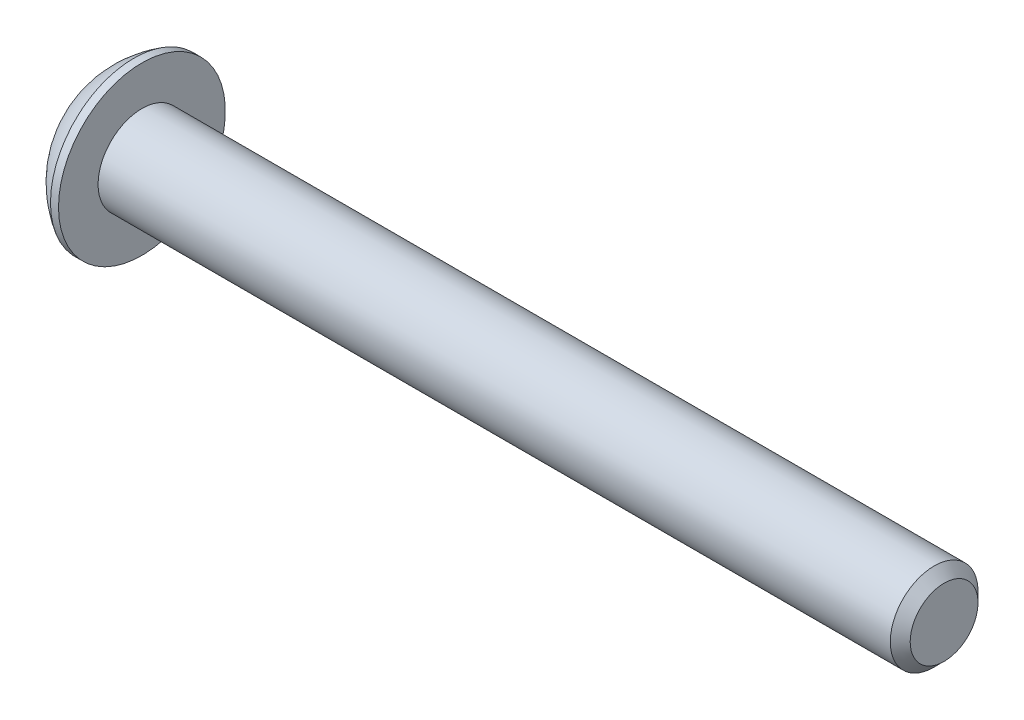
ISO-10303-21;
HEADER;
FILE_DESCRIPTION(('STEP AP214'),'2;1');
FILE_NAME('part.step','',(''),(''),'','','');
FILE_SCHEMA(('AUTOMOTIVE_DESIGN { 1 0 10303 214 1 1 1 1 }'));
ENDSEC;
DATA;
#1=APPLICATION_CONTEXT('core data for automotive mechanical design processes');
#2=APPLICATION_PROTOCOL_DEFINITION('international standard','automotive_design',2000,#1);
#3=PRODUCT_CONTEXT('',#1,'mechanical');
#4=PRODUCT('Part','Part','',(#3));
#5=PRODUCT_RELATED_PRODUCT_CATEGORY('part','',(#4));
#6=PRODUCT_DEFINITION_FORMATION('','',#4);
#7=PRODUCT_DEFINITION_CONTEXT('part definition',#1,'design');
#8=PRODUCT_DEFINITION('design','',#6,#7);
#9=PRODUCT_DEFINITION_SHAPE('','',#8);
#10=(LENGTH_UNIT() NAMED_UNIT(*) SI_UNIT(.MILLI.,.METRE.));
#11=(NAMED_UNIT(*) PLANE_ANGLE_UNIT() SI_UNIT($,.RADIAN.));
#12=(NAMED_UNIT(*) SI_UNIT($,.STERADIAN.) SOLID_ANGLE_UNIT());
#13=UNCERTAINTY_MEASURE_WITH_UNIT(LENGTH_MEASURE(1.E-05),#10,'distance_accuracy_value','');
#14=(GEOMETRIC_REPRESENTATION_CONTEXT(3) GLOBAL_UNCERTAINTY_ASSIGNED_CONTEXT((#13)) GLOBAL_UNIT_ASSIGNED_CONTEXT((#10,
#11,#12)) REPRESENTATION_CONTEXT('',''));
#15=CARTESIAN_POINT('',(0.,0.,0.));
#16=DIRECTION('',(0.,0.,1.));
#17=DIRECTION('',(1.,0.,0.));
#18=AXIS2_PLACEMENT_3D('',#15,#16,#17);
#19=CARTESIAN_POINT('',(1.32080000000034,0.,0.));
#20=DIRECTION('',(-1.,0.,0.));
#21=DIRECTION('',(0.,0.,1.));
#22=AXIS2_PLACEMENT_3D('',#19,#20,#21);
#23=CONICAL_SURFACE('',#22,1.1937999999998,1.04719755119608);
#24=CARTESIAN_POINT('',(2.01004075135902,0.,4.44089209850063E-13));
#25=VERTEX_POINT('',#24);
#26=VERTEX_LOOP('',#25);
#27=FACE_BOUND('',#26,.T.);
#28=CARTESIAN_POINT('',(1.32080000000009,0.,0.));
#29=DIRECTION('',(-1.,0.,0.));
#30=DIRECTION('',(0.,0.,1.));
#31=AXIS2_PLACEMENT_3D('',#28,#29,#30);
#32=CIRCLE('',#31,1.19380000000024);
#33=CARTESIAN_POINT('',(1.32080000000004,-1.03386112703797,0.59690000000006));
#34=VERTEX_POINT('',#33);
#35=CARTESIAN_POINT('',(1.32080000000004,0.,1.19380000000012));
#36=VERTEX_POINT('',#35);
#37=EDGE_CURVE('E19',#34,#36,#32,.T.);
#38=ORIENTED_EDGE('',*,*,#37,.T.);
#39=CARTESIAN_POINT('',(1.32080000000009,0.,0.));
#40=DIRECTION('',(-1.,0.,0.));
#41=DIRECTION('',(0.,0.,1.));
#42=AXIS2_PLACEMENT_3D('',#39,#40,#41);
#43=CIRCLE('',#42,1.19380000000024);
#44=CARTESIAN_POINT('',(1.32080000000004,1.03386112703797,0.596900000000061));
#45=VERTEX_POINT('',#44);
#46=EDGE_CURVE('E148',#36,#45,#43,.T.);
#47=ORIENTED_EDGE('',*,*,#46,.T.);
#48=CARTESIAN_POINT('',(1.32080000000009,0.,0.));
#49=DIRECTION('',(-1.,0.,0.));
#50=DIRECTION('',(0.,0.,1.));
#51=AXIS2_PLACEMENT_3D('',#48,#49,#50);
#52=CIRCLE('',#51,1.19380000000024);
#53=CARTESIAN_POINT('',(1.32080000000004,1.03386112703797,-0.596900000000061));
#54=VERTEX_POINT('',#53);
#55=EDGE_CURVE('E476',#45,#54,#52,.T.);
#56=ORIENTED_EDGE('',*,*,#55,.T.);
#57=CARTESIAN_POINT('',(1.32080000000009,0.,0.));
#58=DIRECTION('',(-1.,0.,0.));
#59=DIRECTION('',(0.,0.,1.));
#60=AXIS2_PLACEMENT_3D('',#57,#58,#59);
#61=CIRCLE('',#60,1.19380000000024);
#62=CARTESIAN_POINT('',(1.32080000000004,1.49457637585666E-12,-1.19380000000012));
#63=VERTEX_POINT('',#62);
#64=EDGE_CURVE('E477',#54,#63,#61,.T.);
#65=ORIENTED_EDGE('',*,*,#64,.T.);
#66=CARTESIAN_POINT('',(1.32080000000009,0.,0.));
#67=DIRECTION('',(-1.,0.,0.));
#68=DIRECTION('',(0.,0.,1.));
#69=AXIS2_PLACEMENT_3D('',#66,#67,#68);
#70=CIRCLE('',#69,1.19380000000024);
#71=CARTESIAN_POINT('',(1.32080000000004,-1.03386112703797,-0.59690000000006));
#72=VERTEX_POINT('',#71);
#73=EDGE_CURVE('E92',#63,#72,#70,.T.);
#74=ORIENTED_EDGE('',*,*,#73,.T.);
#75=CARTESIAN_POINT('',(1.32080000000009,0.,0.));
#76=DIRECTION('',(-1.,0.,0.));
#77=DIRECTION('',(0.,0.,1.));
#78=AXIS2_PLACEMENT_3D('',#75,#76,#77);
#79=CIRCLE('',#78,1.19380000000024);
#80=EDGE_CURVE('E88',#72,#34,#79,.T.);
#81=ORIENTED_EDGE('',*,*,#80,.T.);
#82=EDGE_LOOP('',(#38,#47,#56,#65,#74,#81));
#83=FACE_BOUND('',#82,.T.);
#84=ADVANCED_FACE('F16',(#27,#83),#23,.F.);
#85=CARTESIAN_POINT('',(1.3208,-2.06772225407572,-1.1938));
#86=DIRECTION('',(1.,0.,0.));
#87=DIRECTION('',(0.,0.,-1.));
#88=AXIS2_PLACEMENT_3D('',#85,#86,#87);
#89=PLANE('',#88);
#90=DIRECTION('',(0.,0.5,0.866025403784439));
#91=VECTOR('',#90,1.);
#92=CARTESIAN_POINT('',(1.3208,-1.37848150271715,0.));
#93=LINE('',#92,#91);
#94=CARTESIAN_POINT('',(1.3208,-0.689240751358574,1.1938));
#95=VERTEX_POINT('',#94);
#96=EDGE_CURVE('E100',#95,#34,#93,.F.);
#97=ORIENTED_EDGE('',*,*,#96,.F.);
#98=DIRECTION('',(0.,1.,0.));
#99=VECTOR('',#98,1.);
#100=CARTESIAN_POINT('',(1.3208,-0.689240751358574,1.1938));
#101=LINE('',#100,#99);
#102=EDGE_CURVE('E102',#36,#95,#101,.F.);
#103=ORIENTED_EDGE('',*,*,#102,.F.);
#104=ORIENTED_EDGE('',*,*,#37,.F.);
#105=EDGE_LOOP('',(#97,#103,#104));
#106=FACE_BOUND('',#105,.T.);
#107=ADVANCED_FACE('F98',(#106),#89,.F.);
#108=CARTESIAN_POINT('',(1.3208,-2.06772225407572,-1.1938));
#109=DIRECTION('',(1.,0.,0.));
#110=DIRECTION('',(0.,0.,-1.));
#111=AXIS2_PLACEMENT_3D('',#108,#109,#110);
#112=PLANE('',#111);
#113=DIRECTION('',(0.,-0.5,0.866025403784439));
#114=VECTOR('',#113,1.);
#115=CARTESIAN_POINT('',(1.3208,-0.689240751358574,-1.1938));
#116=LINE('',#115,#114);
#117=CARTESIAN_POINT('',(1.3208,-1.37848150271715,0.));
#118=VERTEX_POINT('',#117);
#119=EDGE_CURVE('E108',#118,#72,#116,.F.);
#120=ORIENTED_EDGE('',*,*,#119,.F.);
#121=DIRECTION('',(0.,0.5,0.866025403784439));
#122=VECTOR('',#121,1.);
#123=CARTESIAN_POINT('',(1.3208,-1.37848150271715,0.));
#124=LINE('',#123,#122);
#125=EDGE_CURVE('E105',#34,#118,#124,.F.);
#126=ORIENTED_EDGE('',*,*,#125,.F.);
#127=ORIENTED_EDGE('',*,*,#80,.F.);
#128=EDGE_LOOP('',(#120,#126,#127));
#129=FACE_BOUND('',#128,.T.);
#130=ADVANCED_FACE('F106',(#129),#112,.F.);
#131=CARTESIAN_POINT('',(1.3208,-2.06772225407572,-1.1938));
#132=DIRECTION('',(1.,0.,0.));
#133=DIRECTION('',(0.,0.,-1.));
#134=AXIS2_PLACEMENT_3D('',#131,#132,#133);
#135=PLANE('',#134);
#136=DIRECTION('',(0.,1.,0.));
#137=VECTOR('',#136,1.);
#138=CARTESIAN_POINT('',(1.3208,0.689240751358577,-1.1938));
#139=LINE('',#138,#137);
#140=CARTESIAN_POINT('',(1.3208,-0.689240751358574,-1.1938));
#141=VERTEX_POINT('',#140);
#142=EDGE_CURVE('E447',#141,#63,#139,.T.);
#143=ORIENTED_EDGE('',*,*,#142,.F.);
#144=DIRECTION('',(0.,-0.5,0.866025403784439));
#145=VECTOR('',#144,1.);
#146=CARTESIAN_POINT('',(1.3208,-0.689240751358574,-1.1938));
#147=LINE('',#146,#145);
#148=EDGE_CURVE('E459',#72,#141,#147,.F.);
#149=ORIENTED_EDGE('',*,*,#148,.F.);
#150=ORIENTED_EDGE('',*,*,#73,.F.);
#151=EDGE_LOOP('',(#143,#149,#150));
#152=FACE_BOUND('',#151,.T.);
#153=ADVANCED_FACE('F191',(#152),#135,.F.);
#154=CARTESIAN_POINT('',(1.3208,-2.06772225407572,-1.1938));
#155=DIRECTION('',(1.,0.,0.));
#156=DIRECTION('',(0.,0.,-1.));
#157=AXIS2_PLACEMENT_3D('',#154,#155,#156);
#158=PLANE('',#157);
#159=DIRECTION('',(0.,-0.5,-0.866025403784439));
#160=VECTOR('',#159,1.);
#161=CARTESIAN_POINT('',(1.3208,1.37848150271715,0.));
#162=LINE('',#161,#160);
#163=CARTESIAN_POINT('',(1.3208,0.689240751358577,-1.1938));
#164=VERTEX_POINT('',#163);
#165=EDGE_CURVE('E433',#164,#54,#162,.F.);
#166=ORIENTED_EDGE('',*,*,#165,.F.);
#167=DIRECTION('',(0.,1.,0.));
#168=VECTOR('',#167,1.);
#169=CARTESIAN_POINT('',(1.3208,0.689240751358577,-1.1938));
#170=LINE('',#169,#168);
#171=EDGE_CURVE('E444',#63,#164,#170,.T.);
#172=ORIENTED_EDGE('',*,*,#171,.F.);
#173=ORIENTED_EDGE('',*,*,#64,.F.);
#174=EDGE_LOOP('',(#166,#172,#173));
#175=FACE_BOUND('',#174,.T.);
#176=ADVANCED_FACE('F187',(#175),#158,.F.);
#177=CARTESIAN_POINT('',(1.3208,-2.06772225407572,-1.1938));
#178=DIRECTION('',(1.,0.,0.));
#179=DIRECTION('',(0.,0.,-1.));
#180=AXIS2_PLACEMENT_3D('',#177,#178,#179);
#181=PLANE('',#180);
#182=DIRECTION('',(0.,0.5,-0.866025403784439));
#183=VECTOR('',#182,1.);
#184=CARTESIAN_POINT('',(1.3208,0.689240751358576,1.1938));
#185=LINE('',#184,#183);
#186=CARTESIAN_POINT('',(1.3208,1.37848150271715,0.));
#187=VERTEX_POINT('',#186);
#188=EDGE_CURVE('E412',#187,#45,#185,.F.);
#189=ORIENTED_EDGE('',*,*,#188,.F.);
#190=DIRECTION('',(0.,-0.5,-0.866025403784439));
#191=VECTOR('',#190,1.);
#192=CARTESIAN_POINT('',(1.3208,1.37848150271715,0.));
#193=LINE('',#192,#191);
#194=EDGE_CURVE('E431',#54,#187,#193,.F.);
#195=ORIENTED_EDGE('',*,*,#194,.F.);
#196=ORIENTED_EDGE('',*,*,#55,.F.);
#197=EDGE_LOOP('',(#189,#195,#196));
#198=FACE_BOUND('',#197,.T.);
#199=ADVANCED_FACE('F183',(#198),#181,.F.);
#200=CARTESIAN_POINT('',(1.3208,-2.06772225407572,-1.1938));
#201=DIRECTION('',(1.,0.,0.));
#202=DIRECTION('',(0.,0.,-1.));
#203=AXIS2_PLACEMENT_3D('',#200,#201,#202);
#204=PLANE('',#203);
#205=DIRECTION('',(0.,1.,0.));
#206=VECTOR('',#205,1.);
#207=CARTESIAN_POINT('',(1.3208,-0.689240751358574,1.1938));
#208=LINE('',#207,#206);
#209=CARTESIAN_POINT('',(1.3208,0.689240751358576,1.1938));
#210=VERTEX_POINT('',#209);
#211=EDGE_CURVE('E117',#210,#36,#208,.F.);
#212=ORIENTED_EDGE('',*,*,#211,.F.);
#213=DIRECTION('',(0.,0.5,-0.866025403784439));
#214=VECTOR('',#213,1.);
#215=CARTESIAN_POINT('',(1.3208,0.689240751358576,1.1938));
#216=LINE('',#215,#214);
#217=EDGE_CURVE('E415',#45,#210,#216,.F.);
#218=ORIENTED_EDGE('',*,*,#217,.F.);
#219=ORIENTED_EDGE('',*,*,#46,.F.);
#220=EDGE_LOOP('',(#212,#218,#219));
#221=FACE_BOUND('',#220,.T.);
#222=ADVANCED_FACE('F179',(#221),#204,.F.);
#223=CARTESIAN_POINT('',(1.3208,-0.689240751358574,1.1938));
#224=DIRECTION('',(0.,0.,-1.));
#225=DIRECTION('',(0.,1.,0.));
#226=AXIS2_PLACEMENT_3D('',#223,#224,#225);
#227=PLANE('',#226);
#228=DIRECTION('',(0.,1.,0.));
#229=VECTOR('',#228,1.);
#230=CARTESIAN_POINT('',(0.,0.,1.1938));
#231=LINE('',#230,#229);
#232=CARTESIAN_POINT('',(0.,0.689240751358577,1.1938));
#233=VERTEX_POINT('',#232);
#234=CARTESIAN_POINT('',(0.,-0.689240751358574,1.1938));
#235=VERTEX_POINT('',#234);
#236=EDGE_CURVE('E409',#233,#235,#231,.F.);
#237=ORIENTED_EDGE('',*,*,#236,.F.);
#238=DIRECTION('',(1.,0.,0.));
#239=VECTOR('',#238,1.);
#240=CARTESIAN_POINT('',(1.3208,0.689240751358576,1.1938));
#241=LINE('',#240,#239);
#242=EDGE_CURVE('E421',#210,#233,#241,.F.);
#243=ORIENTED_EDGE('',*,*,#242,.F.);
#244=ORIENTED_EDGE('',*,*,#211,.T.);
#245=ORIENTED_EDGE('',*,*,#102,.T.);
#246=DIRECTION('',(1.,0.,0.));
#247=VECTOR('',#246,1.);
#248=CARTESIAN_POINT('',(1.3208,-0.689240751358574,1.1938));
#249=LINE('',#248,#247);
#250=EDGE_CURVE('E111',#235,#95,#249,.T.);
#251=ORIENTED_EDGE('',*,*,#250,.F.);
#252=EDGE_LOOP('',(#237,#243,#244,#245,#251));
#253=FACE_BOUND('',#252,.T.);
#254=ADVANCED_FACE('F176',(#253),#227,.T.);
#255=CARTESIAN_POINT('',(1.3208,-1.37848150271715,0.));
#256=DIRECTION('',(0.,0.866025403784439,-0.5));
#257=DIRECTION('',(0.,0.5,0.866025403784439));
#258=AXIS2_PLACEMENT_3D('',#255,#256,#257);
#259=PLANE('',#258);
#260=DIRECTION('',(0.,-0.5,-0.866025403784439));
#261=VECTOR('',#260,1.);
#262=CARTESIAN_POINT('',(0.,-0.689240751358574,1.1938));
#263=LINE('',#262,#261);
#264=CARTESIAN_POINT('',(0.,-1.37848150271715,0.));
#265=VERTEX_POINT('',#264);
#266=EDGE_CURVE('E406',#235,#265,#263,.T.);
#267=ORIENTED_EDGE('',*,*,#266,.F.);
#268=ORIENTED_EDGE('',*,*,#250,.T.);
#269=ORIENTED_EDGE('',*,*,#96,.T.);
#270=ORIENTED_EDGE('',*,*,#125,.T.);
#271=DIRECTION('',(1.,0.,0.));
#272=VECTOR('',#271,1.);
#273=CARTESIAN_POINT('',(1.3208,-1.37848150271715,0.));
#274=LINE('',#273,#272);
#275=EDGE_CURVE('E456',#265,#118,#274,.T.);
#276=ORIENTED_EDGE('',*,*,#275,.F.);
#277=EDGE_LOOP('',(#267,#268,#269,#270,#276));
#278=FACE_BOUND('',#277,.T.);
#279=ADVANCED_FACE('F115',(#278),#259,.T.);
#280=CARTESIAN_POINT('',(1.3208,-0.689240751358574,-1.1938));
#281=DIRECTION('',(0.,0.866025403784439,0.5));
#282=DIRECTION('',(0.,-0.5,0.866025403784439));
#283=AXIS2_PLACEMENT_3D('',#280,#281,#282);
#284=PLANE('',#283);
#285=DIRECTION('',(0.,0.5,-0.866025403784439));
#286=VECTOR('',#285,1.);
#287=CARTESIAN_POINT('',(0.,-1.37848150271715,0.));
#288=LINE('',#287,#286);
#289=CARTESIAN_POINT('',(0.,-0.689240751358574,-1.1938));
#290=VERTEX_POINT('',#289);
#291=EDGE_CURVE('E403',#265,#290,#288,.T.);
#292=ORIENTED_EDGE('',*,*,#291,.F.);
#293=ORIENTED_EDGE('',*,*,#275,.T.);
#294=ORIENTED_EDGE('',*,*,#119,.T.);
#295=ORIENTED_EDGE('',*,*,#148,.T.);
#296=DIRECTION('',(1.,0.,0.));
#297=VECTOR('',#296,1.);
#298=CARTESIAN_POINT('',(1.3208,-0.689240751358574,-1.1938));
#299=LINE('',#298,#297);
#300=EDGE_CURVE('E441',#290,#141,#299,.T.);
#301=ORIENTED_EDGE('',*,*,#300,.F.);
#302=EDGE_LOOP('',(#292,#293,#294,#295,#301));
#303=FACE_BOUND('',#302,.T.);
#304=ADVANCED_FACE('F169',(#303),#284,.T.);
#305=CARTESIAN_POINT('',(1.3208,0.689240751358577,-1.1938));
#306=DIRECTION('',(0.,0.,1.));
#307=DIRECTION('',(1.,0.,0.));
#308=AXIS2_PLACEMENT_3D('',#305,#306,#307);
#309=PLANE('',#308);
#310=DIRECTION('',(0.,1.,0.));
#311=VECTOR('',#310,1.);
#312=CARTESIAN_POINT('',(0.,0.,-1.1938));
#313=LINE('',#312,#311);
#314=CARTESIAN_POINT('',(0.,0.689240751358577,-1.1938));
#315=VERTEX_POINT('',#314);
#316=EDGE_CURVE('E400',#290,#315,#313,.T.);
#317=ORIENTED_EDGE('',*,*,#316,.F.);
#318=ORIENTED_EDGE('',*,*,#300,.T.);
#319=ORIENTED_EDGE('',*,*,#142,.T.);
#320=ORIENTED_EDGE('',*,*,#171,.T.);
#321=DIRECTION('',(1.,0.,0.));
#322=VECTOR('',#321,1.);
#323=CARTESIAN_POINT('',(1.3208,0.689240751358577,-1.1938));
#324=LINE('',#323,#322);
#325=EDGE_CURVE('E416',#315,#164,#324,.T.);
#326=ORIENTED_EDGE('',*,*,#325,.F.);
#327=EDGE_LOOP('',(#317,#318,#319,#320,#326));
#328=FACE_BOUND('',#327,.T.);
#329=ADVANCED_FACE('F166',(#328),#309,.T.);
#330=CARTESIAN_POINT('',(1.3208,1.37848150271715,0.));
#331=DIRECTION('',(0.,-0.866025403784439,0.5));
#332=DIRECTION('',(0.,-0.5,-0.866025403784439));
#333=AXIS2_PLACEMENT_3D('',#330,#331,#332);
#334=PLANE('',#333);
#335=DIRECTION('',(0.,0.5,0.866025403784439));
#336=VECTOR('',#335,1.);
#337=CARTESIAN_POINT('',(0.,0.689240751358577,-1.1938));
#338=LINE('',#337,#336);
#339=CARTESIAN_POINT('',(0.,1.37848150271715,0.));
#340=VERTEX_POINT('',#339);
#341=EDGE_CURVE('E397',#315,#340,#338,.T.);
#342=ORIENTED_EDGE('',*,*,#341,.F.);
#343=ORIENTED_EDGE('',*,*,#325,.T.);
#344=ORIENTED_EDGE('',*,*,#165,.T.);
#345=ORIENTED_EDGE('',*,*,#194,.T.);
#346=DIRECTION('',(1.,0.,0.));
#347=VECTOR('',#346,1.);
#348=CARTESIAN_POINT('',(1.3208,1.37848150271715,0.));
#349=LINE('',#348,#347);
#350=EDGE_CURVE('E34',#340,#187,#349,.T.);
#351=ORIENTED_EDGE('',*,*,#350,.F.);
#352=EDGE_LOOP('',(#342,#343,#344,#345,#351));
#353=FACE_BOUND('',#352,.T.);
#354=ADVANCED_FACE('F162',(#353),#334,.T.);
#355=CARTESIAN_POINT('',(1.3208,0.689240751358576,1.1938));
#356=DIRECTION('',(0.,-0.866025403784439,-0.5));
#357=DIRECTION('',(0.,0.5,-0.866025403784439));
#358=AXIS2_PLACEMENT_3D('',#355,#356,#357);
#359=PLANE('',#358);
#360=DIRECTION('',(0.,-0.5,0.866025403784439));
#361=VECTOR('',#360,1.);
#362=CARTESIAN_POINT('',(0.,1.37848150271715,0.));
#363=LINE('',#362,#361);
#364=EDGE_CURVE('E147',#340,#233,#363,.T.);
#365=ORIENTED_EDGE('',*,*,#364,.F.);
#366=ORIENTED_EDGE('',*,*,#350,.T.);
#367=ORIENTED_EDGE('',*,*,#188,.T.);
#368=ORIENTED_EDGE('',*,*,#217,.T.);
#369=ORIENTED_EDGE('',*,*,#242,.T.);
#370=EDGE_LOOP('',(#365,#366,#367,#368,#369));
#371=FACE_BOUND('',#370,.T.);
#372=ADVANCED_FACE('F158',(#371),#359,.T.);
#373=CARTESIAN_POINT('',(0.,0.,0.));
#374=DIRECTION('',(-1.,0.,0.));
#375=DIRECTION('',(0.,0.,1.));
#376=AXIS2_PLACEMENT_3D('',#373,#374,#375);
#377=PLANE('',#376);
#378=ORIENTED_EDGE('',*,*,#341,.T.);
#379=ORIENTED_EDGE('',*,*,#364,.T.);
#380=ORIENTED_EDGE('',*,*,#236,.T.);
#381=ORIENTED_EDGE('',*,*,#266,.T.);
#382=ORIENTED_EDGE('',*,*,#291,.T.);
#383=ORIENTED_EDGE('',*,*,#316,.T.);
#384=EDGE_LOOP('',(#378,#379,#380,#381,#382,#383));
#385=FACE_BOUND('',#384,.T.);
#386=CARTESIAN_POINT('',(0.,1.9812,0.));
#387=CARTESIAN_POINT('',(0.,1.9811996664299,0.0556258831179428));
#388=CARTESIAN_POINT('',(0.,1.97885520380442,0.111261989398606));
#389=CARTESIAN_POINT('',(0.,1.96949260169541,0.222149719830458));
#390=CARTESIAN_POINT('',(0.,1.96247308239605,0.277401225602895));
#391=CARTESIAN_POINT('',(0.,1.94379192841038,0.387209508139747));
#392=CARTESIAN_POINT('',(-1.85325793235264E-13,1.93212292489526,0.441765039546365));
#393=CARTESIAN_POINT('',(1.86344214223505E-13,1.90422331175315,0.549729449347493));
#394=CARTESIAN_POINT('',(6.94543371897454E-13,1.88798900035338,0.603137359208869));
#395=CARTESIAN_POINT('',(1.15501975216981E-12,1.83266214476501,0.760839131321828));
#396=CARTESIAN_POINT('',(0.,1.78690023648845,0.862876433575429));
#397=CARTESIAN_POINT('',(0.,1.67887358150667,1.05780719540872));
#398=CARTESIAN_POINT('',(9.54193214892627E-13,1.6166082074585,1.15070030720801));
#399=CARTESIAN_POINT('',(5.94805591894675E-13,1.51224157140982,1.28116890915697));
#400=CARTESIAN_POINT('',(1.63221293851378E-13,1.4755970394354,1.32320451127026));
#401=CARTESIAN_POINT('',(-1.62196980336157E-13,1.39893832619713,1.40400288695709));
#402=CARTESIAN_POINT('',(0.,1.35892742784698,1.44276877695455));
#403=CARTESIAN_POINT('',(1.14362537325405E-13,1.23416504602197,1.55382272417904));
#404=CARTESIAN_POINT('',(0.,1.14466125559859,1.62089527952111));
#405=CARTESIAN_POINT('',(0.,0.955712144178167,1.7390221808118));
#406=CARTESIAN_POINT('',(0.,0.856267198233564,1.79007713076007));
#407=CARTESIAN_POINT('',(0.,0.650206345910843,1.87477637530954));
#408=CARTESIAN_POINT('',(0.,0.543590516134855,1.90842085586267));
#409=CARTESIAN_POINT('',(0.,0.326226155292018,1.95733039300656));
#410=CARTESIAN_POINT('',(0.,0.21547760215793,1.97259535144288));
#411=CARTESIAN_POINT('',(0.,-0.00701040587544639,1.98431697865418));
#412=CARTESIAN_POINT('',(0.,-0.118749860774734,1.98077364742917));
#413=CARTESIAN_POINT('',(0.,-0.340050178355485,1.95497485623825));
#414=CARTESIAN_POINT('',(0.,-0.449611052668255,1.93271949620218));
#415=CARTESIAN_POINT('',(0.,-0.663431110729174,1.87014138774523));
#416=CARTESIAN_POINT('',(0.,-0.76769023783852,1.82981844635272));
#417=CARTESIAN_POINT('',(0.,-0.968005760719347,1.73219968377096));
#418=CARTESIAN_POINT('',(0.,-1.0640618469811,1.6749032225164));
#419=CARTESIAN_POINT('',(0.,-1.19980276751283,1.57757371205873));
#420=CARTESIAN_POINT('',(0.,-1.24366557129213,1.54322665019466));
#421=CARTESIAN_POINT('',(0.,-1.32838995706696,1.47093063174264));
#422=CARTESIAN_POINT('',(0.,-1.36924860178706,1.43297823102439));
#423=CARTESIAN_POINT('',(0.,-1.48674671849223,1.31419842051173));
#424=CARTESIAN_POINT('',(0.,-1.55842832343237,1.22836221289311));
#425=CARTESIAN_POINT('',(0.,-1.6863396856475,1.04586168272493));
#426=CARTESIAN_POINT('',(0.,-1.7425700302488,0.949197771949774));
#427=CARTESIAN_POINT('',(0.,-1.8141614250401,0.798182600298684));
#428=CARTESIAN_POINT('',(0.,-1.83591780585875,0.746776203847791));
#429=CARTESIAN_POINT('',(0.,-1.87500754181092,0.642341081688636));
#430=CARTESIAN_POINT('',(0.,-1.89234447645404,0.589313708122847));
#431=CARTESIAN_POINT('',(0.,-1.92246053433554,0.482076273028395));
#432=CARTESIAN_POINT('',(0.,-1.93524685475118,0.42786822425751));
#433=CARTESIAN_POINT('',(0.,-1.95620937250494,0.318578151844611));
#434=CARTESIAN_POINT('',(0.,-1.96438692958147,0.263496390912872));
#435=CARTESIAN_POINT('',(0.,-1.97388528284653,0.173607715038558));
#436=CARTESIAN_POINT('',(0.,-1.97662743364426,0.138944718024998));
#437=CARTESIAN_POINT('',(0.,-1.98028489645283,0.0695224782567002));
#438=CARTESIAN_POINT('',(0.,-1.98120020846367,0.0347632355019631));
#439=CARTESIAN_POINT('',(0.,-1.9811996664299,-0.0556258831179437));
#440=CARTESIAN_POINT('',(0.,-1.97885520380442,-0.111261989398607));
#441=CARTESIAN_POINT('',(0.,-1.96949260169541,-0.222149719830459));
#442=CARTESIAN_POINT('',(0.,-1.96247308239605,-0.277401225602897));
#443=CARTESIAN_POINT('',(0.,-1.94379192841039,-0.387209508139749));
#444=CARTESIAN_POINT('',(-1.85269749640691E-13,-1.93212292489526,-0.441765039546367));
#445=CARTESIAN_POINT('',(1.86288125054388E-13,-1.90422331175315,-0.549729449347495));
#446=CARTESIAN_POINT('',(6.94525090263764E-13,-1.88798900035338,-0.603137359208872));
#447=CARTESIAN_POINT('',(1.15505622829081E-12,-1.83266214476501,-0.760839131321831));
#448=CARTESIAN_POINT('',(0.,-1.78690023648845,-0.862876433575431));
#449=CARTESIAN_POINT('',(0.,-1.67887358150667,-1.05780719540872));
#450=CARTESIAN_POINT('',(9.54248812869379E-13,-1.6166082074585,-1.15070030720801));
#451=CARTESIAN_POINT('',(5.94777756479239E-13,-1.51224157140982,-1.28116890915698));
#452=CARTESIAN_POINT('',(1.63138949183833E-13,-1.47559703943539,-1.32320451127027));
#453=CARTESIAN_POINT('',(-1.62114715061273E-13,-1.39893832619713,-1.40400288695709));
#454=CARTESIAN_POINT('',(0.,-1.35892742784699,-1.44276877695455));
#455=CARTESIAN_POINT('',(1.13760489124207E-13,-1.23416504602197,-1.55382272417904));
#456=CARTESIAN_POINT('',(0.,-1.14466125559859,-1.62089527952111));
#457=CARTESIAN_POINT('',(0.,-0.95571214417816,-1.73902218081179));
#458=CARTESIAN_POINT('',(0.,-0.856267198233559,-1.79007713076007));
#459=CARTESIAN_POINT('',(0.,-0.650206345910841,-1.87477637530954));
#460=CARTESIAN_POINT('',(0.,-0.543590516134854,-1.90842085586267));
#461=CARTESIAN_POINT('',(0.,-0.326226155292018,-1.95733039300657));
#462=CARTESIAN_POINT('',(0.,-0.215477602157929,-1.97259535144288));
#463=CARTESIAN_POINT('',(0.,0.0070104058754487,-1.98431697865418));
#464=CARTESIAN_POINT('',(0.,0.118749860774737,-1.98077364742916));
#465=CARTESIAN_POINT('',(0.,0.340050178355489,-1.95497485623824));
#466=CARTESIAN_POINT('',(0.,0.44961105266826,-1.93271949620218));
#467=CARTESIAN_POINT('',(0.,0.663431110729178,-1.87014138774524));
#468=CARTESIAN_POINT('',(0.,0.767690237838524,-1.82981844635272));
#469=CARTESIAN_POINT('',(0.,0.968005760719348,-1.73219968377096));
#470=CARTESIAN_POINT('',(0.,1.0640618469811,-1.67490322251639));
#471=CARTESIAN_POINT('',(0.,1.19980276751283,-1.57757371205873));
#472=CARTESIAN_POINT('',(0.,1.24366557129214,-1.54322665019465));
#473=CARTESIAN_POINT('',(0.,1.32838995706696,-1.47093063174263));
#474=CARTESIAN_POINT('',(0.,1.36924860178706,-1.43297823102439));
#475=CARTESIAN_POINT('',(0.,1.48674671849223,-1.31419842051172));
#476=CARTESIAN_POINT('',(0.,1.55842832343237,-1.22836221289311));
#477=CARTESIAN_POINT('',(0.,1.6863396856475,-1.04586168272492));
#478=CARTESIAN_POINT('',(0.,1.7425700302488,-0.949197771949768));
#479=CARTESIAN_POINT('',(0.,1.8141614250401,-0.798182600298677));
#480=CARTESIAN_POINT('',(0.,1.83591780585875,-0.746776203847785));
#481=CARTESIAN_POINT('',(0.,1.87500754181092,-0.64234108168863));
#482=CARTESIAN_POINT('',(0.,1.89234447645404,-0.589313708122841));
#483=CARTESIAN_POINT('',(0.,1.92246053433555,-0.482076273028389));
#484=CARTESIAN_POINT('',(0.,1.93524685475118,-0.427868224257505));
#485=CARTESIAN_POINT('',(0.,1.95620937250494,-0.318578151844605));
#486=CARTESIAN_POINT('',(0.,1.96438692958147,-0.263496390912866));
#487=CARTESIAN_POINT('',(0.,1.97388528284653,-0.173607715038553));
#488=CARTESIAN_POINT('',(0.,1.97662743364426,-0.138944718024994));
#489=CARTESIAN_POINT('',(0.,1.98028489645283,-0.0695224782566989));
#490=CARTESIAN_POINT('',(0.,1.98120020846367,-0.034763235501963));
#491=CARTESIAN_POINT('',(0.,1.9812,0.));
#492=B_SPLINE_CURVE_WITH_KNOTS('',3,(#386,#387,#388,#389,#390,#391,#392,#393,#394,#395,#396,
#397,#398,#399,#400,#401,#402,#403,#404,#405,#406,#407,#408,#409,#410,#411,#412,#413,#414,#415,
#416,#417,#418,#419,#420,#421,#422,#423,#424,#425,#426,#427,#428,#429,#430,#431,#432,#433,#434,
#435,#436,#437,#438,#439,#440,#441,#442,#443,#444,#445,#446,#447,#448,#449,#450,#451,#452,#453,
#454,#455,#456,#457,#458,#459,#460,#461,#462,#463,#464,#465,#466,#467,#468,#469,#470,#471,#472,
#473,#474,#475,#476,#477,#478,#479,#480,#481,#482,#483,#484,#485,#486,#487,#488,#489,#490,#491),
.UNSPECIFIED.,.T.,.F.,(4,2,2,2,2,2,2,2,2,2,2,2,2,2,2,2,2,2,2,2,2,2,2,2,2,2,2,2,2,2,2,2,2,2,2,2,
2,2,2,2,2,2,2,2,2,2,2,2,2,2,2,2,4),(0.,0.166845646007828,0.333740557374255,0.500901034367693,
0.668197445942386,1.00199278686282,1.33580081809885,1.50292354032982,1.6698851310853,
2.00370118900129,2.33750465770544,2.67130456115909,3.005106247238,3.33890793331696,
3.67270783677065,4.00651130547476,4.34032736339026,4.50728895414554,4.67441167637632,
5.00821970761259,5.34201504853332,5.50931146010827,5.67647193710191,5.84336684846844,
6.0102124944764,6.11448220058334,6.21875190669029,6.38559755269812,6.55249246406454,
6.71965294105798,6.88694935263268,7.22074469355311,7.55455272478915,7.72167544702011,
7.88863703777559,8.22245309569158,8.55625656439573,8.89005646784938,9.2238581539283,
9.55765984000725,9.89145974346094,10.2252632121651,10.5590792700806,10.7260408608358,
10.8931635830666,11.2269716143029,11.5607669552236,11.7280633667986,11.8952238437922,
12.0621187551587,12.2289644011667,12.3332341072736,12.4375038133806),.UNSPECIFIED.);
#493=CARTESIAN_POINT('',(0.,1.9812,0.));
#494=VERTEX_POINT('',#493);
#495=EDGE_CURVE('E139',#494,#494,#492,.T.);
#496=ORIENTED_EDGE('',*,*,#495,.F.);
#497=EDGE_LOOP('',(#496));
#498=FACE_BOUND('',#497,.T.);
#499=ADVANCED_FACE('F154',(#385,#498),#377,.T.);
#500=CARTESIAN_POINT('',(4.13385,0.,0.));
#501=DIRECTION('',(0.,1.,0.));
#502=DIRECTION('',(1.,0.,0.));
#503=AXIS2_PLACEMENT_3D('',#500,#501,#502);
#504=SPHERICAL_SURFACE('',#503,4.58408870578439);
#505=CARTESIAN_POINT('',(1.8288,0.,0.));
#506=DIRECTION('',(-1.,0.,0.));
#507=DIRECTION('',(0.,0.,1.));
#508=AXIS2_PLACEMENT_3D('',#505,#506,#507);
#509=CIRCLE('',#508,3.9624);
#510=CARTESIAN_POINT('',(1.8288,0.,3.9624));
#511=VERTEX_POINT('',#510);
#512=EDGE_CURVE('E136',#511,#511,#509,.F.);
#513=ORIENTED_EDGE('',*,*,#512,.F.);
#514=EDGE_LOOP('',(#513));
#515=FACE_BOUND('',#514,.T.);
#516=ORIENTED_EDGE('',*,*,#495,.T.);
#517=EDGE_LOOP('',(#516));
#518=FACE_BOUND('',#517,.T.);
#519=ADVANCED_FACE('F150',(#515,#518),#504,.T.);
#520=CARTESIAN_POINT('',(40.3098,0.,0.));
#521=DIRECTION('',(-1.,0.,0.));
#522=DIRECTION('',(0.,0.,1.));
#523=AXIS2_PLACEMENT_3D('',#520,#521,#522);
#524=PLANE('',#523);
#525=CARTESIAN_POINT('',(40.3097999999886,0.,0.));
#526=DIRECTION('',(-1.,0.,0.));
#527=DIRECTION('',(0.,0.,1.));
#528=AXIS2_PLACEMENT_3D('',#525,#526,#527);
#529=CIRCLE('',#528,1.61036000002923);
#530=CARTESIAN_POINT('',(40.3097999999886,0.,1.61036000002923));
#531=VERTEX_POINT('',#530);
#532=EDGE_CURVE('E133',#531,#531,#529,.T.);
#533=ORIENTED_EDGE('',*,*,#532,.F.);
#534=EDGE_LOOP('',(#533));
#535=FACE_BOUND('',#534,.T.);
#536=ADVANCED_FACE('F221',(#535),#524,.F.);
#537=CARTESIAN_POINT('',(0.,0.,0.));
#538=DIRECTION('',(-1.,0.,0.));
#539=DIRECTION('',(0.,0.,1.));
#540=AXIS2_PLACEMENT_3D('',#537,#538,#539);
#541=CYLINDRICAL_SURFACE('',#540,3.9624);
#542=ORIENTED_EDGE('',*,*,#512,.T.);
#543=EDGE_LOOP('',(#542));
#544=FACE_BOUND('',#543,.T.);
#545=CARTESIAN_POINT('',(2.2098,0.,0.));
#546=DIRECTION('',(-1.,0.,0.));
#547=DIRECTION('',(0.,0.,1.));
#548=AXIS2_PLACEMENT_3D('',#545,#546,#547);
#549=CIRCLE('',#548,3.9624);
#550=CARTESIAN_POINT('',(2.2098,0.,3.9624));
#551=VERTEX_POINT('',#550);
#552=EDGE_CURVE('E130',#551,#551,#549,.T.);
#553=ORIENTED_EDGE('',*,*,#552,.T.);
#554=EDGE_LOOP('',(#553));
#555=FACE_BOUND('',#554,.T.);
#556=ADVANCED_FACE('F218',(#544,#555),#541,.T.);
#557=CARTESIAN_POINT('',(39.8373600000923,0.,0.));
#558=DIRECTION('',(-1.,0.,0.));
#559=DIRECTION('',(0.,0.,1.));
#560=AXIS2_PLACEMENT_3D('',#557,#558,#559);
#561=CONICAL_SURFACE('',#560,2.08279999992556,0.785398163397448);
#562=CARTESIAN_POINT('',(39.83736,0.,0.));
#563=DIRECTION('',(-1.,0.,0.));
#564=DIRECTION('',(0.,0.,1.));
#565=AXIS2_PLACEMENT_3D('',#562,#563,#564);
#566=CIRCLE('',#565,2.0828);
#567=CARTESIAN_POINT('',(39.83736,0.,2.0828));
#568=VERTEX_POINT('',#567);
#569=EDGE_CURVE('E25',#568,#568,#566,.T.);
#570=ORIENTED_EDGE('',*,*,#569,.F.);
#571=EDGE_LOOP('',(#570));
#572=FACE_BOUND('',#571,.T.);
#573=ORIENTED_EDGE('',*,*,#532,.T.);
#574=EDGE_LOOP('',(#573));
#575=FACE_BOUND('',#574,.T.);
#576=ADVANCED_FACE('F211',(#572,#575),#561,.T.);
#577=CARTESIAN_POINT('',(2.2098,2.0828,0.));
#578=DIRECTION('',(-1.,0.,0.));
#579=DIRECTION('',(0.,0.,1.));
#580=AXIS2_PLACEMENT_3D('',#577,#578,#579);
#581=PLANE('',#580);
#582=CARTESIAN_POINT('',(2.2098,0.,0.));
#583=DIRECTION('',(-1.,0.,0.));
#584=DIRECTION('',(0.,0.,1.));
#585=AXIS2_PLACEMENT_3D('',#582,#583,#584);
#586=CIRCLE('',#585,2.0828);
#587=CARTESIAN_POINT('',(2.2098,0.,2.0828));
#588=VERTEX_POINT('',#587);
#589=EDGE_CURVE('E11',#588,#588,#586,.F.);
#590=ORIENTED_EDGE('',*,*,#589,.F.);
#591=EDGE_LOOP('',(#590));
#592=FACE_BOUND('',#591,.T.);
#593=ORIENTED_EDGE('',*,*,#552,.F.);
#594=EDGE_LOOP('',(#593));
#595=FACE_BOUND('',#594,.T.);
#596=ADVANCED_FACE('F205',(#592,#595),#581,.F.);
#597=CARTESIAN_POINT('',(0.,0.,0.));
#598=DIRECTION('',(-1.,0.,0.));
#599=DIRECTION('',(0.,0.,1.));
#600=AXIS2_PLACEMENT_3D('',#597,#598,#599);
#601=CYLINDRICAL_SURFACE('',#600,2.0828);
#602=ORIENTED_EDGE('',*,*,#589,.T.);
#603=EDGE_LOOP('',(#602));
#604=FACE_BOUND('',#603,.T.);
#605=ORIENTED_EDGE('',*,*,#569,.T.);
#606=EDGE_LOOP('',(#605));
#607=FACE_BOUND('',#606,.T.);
#608=ADVANCED_FACE('F203',(#604,#607),#601,.T.);
#609=CLOSED_SHELL('',(#84,#107,#130,#153,#176,#199,#222,#254,#279,#304,#329,#354,#372,#499,#519,
#536,#556,#576,#596,#608));
#610=MANIFOLD_SOLID_BREP('B1',#609);
#611=ADVANCED_BREP_SHAPE_REPRESENTATION('',(#18,#610),#14);
#612=SHAPE_DEFINITION_REPRESENTATION(#9,#611);
ENDSEC;
END-ISO-10303-21;
